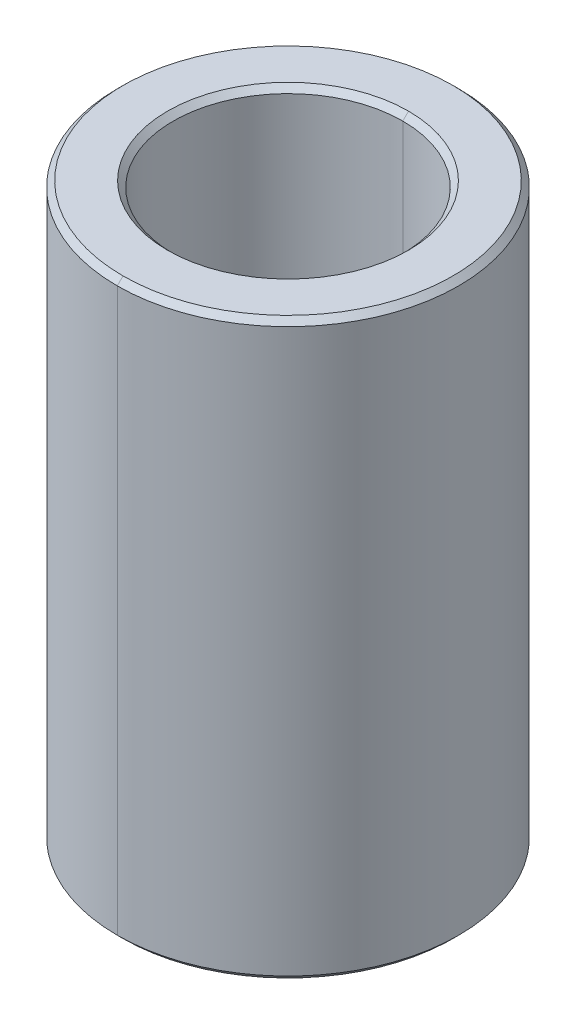
ISO-10303-21;
HEADER;
FILE_DESCRIPTION(('STEP AP214'),'2;1');
FILE_NAME('part.step','',(''),(''),'','','');
FILE_SCHEMA(('AUTOMOTIVE_DESIGN { 1 0 10303 214 1 1 1 1 }'));
ENDSEC;
DATA;
#1=APPLICATION_CONTEXT('core data for automotive mechanical design processes');
#2=APPLICATION_PROTOCOL_DEFINITION('international standard','automotive_design',2000,#1);
#3=PRODUCT_CONTEXT('',#1,'mechanical');
#4=PRODUCT('Part','Part','',(#3));
#5=PRODUCT_RELATED_PRODUCT_CATEGORY('part','',(#4));
#6=PRODUCT_DEFINITION_FORMATION('','',#4);
#7=PRODUCT_DEFINITION_CONTEXT('part definition',#1,'design');
#8=PRODUCT_DEFINITION('design','',#6,#7);
#9=PRODUCT_DEFINITION_SHAPE('','',#8);
#10=(LENGTH_UNIT() NAMED_UNIT(*) SI_UNIT(.MILLI.,.METRE.));
#11=(NAMED_UNIT(*) PLANE_ANGLE_UNIT() SI_UNIT($,.RADIAN.));
#12=(NAMED_UNIT(*) SI_UNIT($,.STERADIAN.) SOLID_ANGLE_UNIT());
#13=UNCERTAINTY_MEASURE_WITH_UNIT(LENGTH_MEASURE(1.E-05),#10,'distance_accuracy_value','');
#14=(GEOMETRIC_REPRESENTATION_CONTEXT(3) GLOBAL_UNCERTAINTY_ASSIGNED_CONTEXT((#13)) GLOBAL_UNIT_ASSIGNED_CONTEXT((#10,
#11,#12)) REPRESENTATION_CONTEXT('',''));
#15=CARTESIAN_POINT('',(0.,0.,0.));
#16=DIRECTION('',(0.,0.,1.));
#17=DIRECTION('',(1.,0.,0.));
#18=AXIS2_PLACEMENT_3D('',#15,#16,#17);
#19=CARTESIAN_POINT('',(0.,4.9,0.));
#20=DIRECTION('',(0.,1.,0.));
#21=DIRECTION('',(0.,0.,1.));
#22=AXIS2_PLACEMENT_3D('',#19,#20,#21);
#23=CONICAL_SURFACE('',#22,2.,0.785398163397448);
#24=DIRECTION('',(0.,0.707106781186548,-0.707106781186548));
#25=VECTOR('',#24,1.);
#26=CARTESIAN_POINT('',(0.,4.9,-2.));
#27=LINE('',#26,#25);
#28=CARTESIAN_POINT('',(0.,4.9,-2.));
#29=VERTEX_POINT('',#28);
#30=CARTESIAN_POINT('',(0.,5.,-2.1));
#31=VERTEX_POINT('',#30);
#32=EDGE_CURVE('E185',#29,#31,#27,.T.);
#33=ORIENTED_EDGE('',*,*,#32,.F.);
#34=CARTESIAN_POINT('',(0.,4.9,0.));
#35=DIRECTION('',(0.,1.,0.));
#36=DIRECTION('',(0.,0.,1.));
#37=AXIS2_PLACEMENT_3D('',#34,#35,#36);
#38=CIRCLE('',#37,2.);
#39=CARTESIAN_POINT('',(0.,4.9,2.));
#40=VERTEX_POINT('',#39);
#41=EDGE_CURVE('E25',#40,#29,#38,.T.);
#42=ORIENTED_EDGE('',*,*,#41,.F.);
#43=DIRECTION('',(0.,0.707106781186548,0.707106781186548));
#44=VECTOR('',#43,1.);
#45=CARTESIAN_POINT('',(0.,4.9,2.));
#46=LINE('',#45,#44);
#47=CARTESIAN_POINT('',(0.,5.,2.1));
#48=VERTEX_POINT('',#47);
#49=EDGE_CURVE('E198',#40,#48,#46,.T.);
#50=ORIENTED_EDGE('',*,*,#49,.T.);
#51=CARTESIAN_POINT('',(0.,5.,0.));
#52=DIRECTION('',(0.,-1.,0.));
#53=DIRECTION('',(0.,0.,1.));
#54=AXIS2_PLACEMENT_3D('',#51,#52,#53);
#55=CIRCLE('',#54,2.1);
#56=EDGE_CURVE('E119',#31,#48,#55,.T.);
#57=ORIENTED_EDGE('',*,*,#56,.F.);
#58=EDGE_LOOP('',(#33,#42,#50,#57));
#59=FACE_BOUND('',#58,.T.);
#60=ADVANCED_FACE('F15',(#59),#23,.F.);
#61=CARTESIAN_POINT('',(0.,-5.,0.));
#62=DIRECTION('',(0.,-1.,0.));
#63=DIRECTION('',(0.,0.,-1.));
#64=AXIS2_PLACEMENT_3D('',#61,#62,#63);
#65=CONICAL_SURFACE('',#64,2.1,0.785398163397443);
#66=DIRECTION('',(0.,-0.707106781186551,0.707106781186545));
#67=VECTOR('',#66,1.);
#68=CARTESIAN_POINT('',(0.,-5.,2.1));
#69=LINE('',#68,#67);
#70=CARTESIAN_POINT('',(0.,-4.9,2.));
#71=VERTEX_POINT('',#70);
#72=CARTESIAN_POINT('',(0.,-5.,2.1));
#73=VERTEX_POINT('',#72);
#74=EDGE_CURVE('E189',#71,#73,#69,.T.);
#75=ORIENTED_EDGE('',*,*,#74,.F.);
#76=CARTESIAN_POINT('',(0.,-4.9,0.));
#77=DIRECTION('',(0.,-1.,0.));
#78=DIRECTION('',(0.,0.,1.));
#79=AXIS2_PLACEMENT_3D('',#76,#77,#78);
#80=CIRCLE('',#79,2.);
#81=CARTESIAN_POINT('',(0.,-4.9,-2.));
#82=VERTEX_POINT('',#81);
#83=EDGE_CURVE('E10',#82,#71,#80,.T.);
#84=ORIENTED_EDGE('',*,*,#83,.F.);
#85=DIRECTION('',(0.,-0.707106781186551,-0.707106781186545));
#86=VECTOR('',#85,1.);
#87=CARTESIAN_POINT('',(0.,-5.,-2.1));
#88=LINE('',#87,#86);
#89=CARTESIAN_POINT('',(0.,-5.,-2.1));
#90=VERTEX_POINT('',#89);
#91=EDGE_CURVE('E131',#82,#90,#88,.T.);
#92=ORIENTED_EDGE('',*,*,#91,.T.);
#93=CARTESIAN_POINT('',(0.,-5.,0.));
#94=DIRECTION('',(0.,1.,0.));
#95=DIRECTION('',(0.,0.,1.));
#96=AXIS2_PLACEMENT_3D('',#93,#94,#95);
#97=CIRCLE('',#96,2.1);
#98=EDGE_CURVE('E82',#73,#90,#97,.T.);
#99=ORIENTED_EDGE('',*,*,#98,.F.);
#100=EDGE_LOOP('',(#75,#84,#92,#99));
#101=FACE_BOUND('',#100,.T.);
#102=ADVANCED_FACE('F250',(#101),#65,.F.);
#103=CARTESIAN_POINT('',(0.,5.,0.));
#104=DIRECTION('',(0.,-1.,0.));
#105=DIRECTION('',(0.,0.,-1.));
#106=AXIS2_PLACEMENT_3D('',#103,#104,#105);
#107=CONICAL_SURFACE('',#106,2.875,0.78539816339744);
#108=DIRECTION('',(0.,-0.707106781186554,0.707106781186542));
#109=VECTOR('',#108,1.);
#110=CARTESIAN_POINT('',(0.,5.,2.875));
#111=LINE('',#110,#109);
#112=CARTESIAN_POINT('',(0.,5.,2.875));
#113=VERTEX_POINT('',#112);
#114=CARTESIAN_POINT('',(0.,4.9,2.975));
#115=VERTEX_POINT('',#114);
#116=EDGE_CURVE('E114',#113,#115,#111,.T.);
#117=ORIENTED_EDGE('',*,*,#116,.F.);
#118=CARTESIAN_POINT('',(0.,5.,0.));
#119=DIRECTION('',(0.,1.,0.));
#120=DIRECTION('',(0.,0.,1.));
#121=AXIS2_PLACEMENT_3D('',#118,#119,#120);
#122=CIRCLE('',#121,2.875);
#123=CARTESIAN_POINT('',(0.,5.,-2.875));
#124=VERTEX_POINT('',#123);
#125=EDGE_CURVE('E108',#124,#113,#122,.T.);
#126=ORIENTED_EDGE('',*,*,#125,.F.);
#127=DIRECTION('',(0.,-0.707106781186554,-0.707106781186542));
#128=VECTOR('',#127,1.);
#129=CARTESIAN_POINT('',(0.,5.,-2.875));
#130=LINE('',#129,#128);
#131=CARTESIAN_POINT('',(0.,4.9,-2.975));
#132=VERTEX_POINT('',#131);
#133=EDGE_CURVE('E111',#124,#132,#130,.T.);
#134=ORIENTED_EDGE('',*,*,#133,.T.);
#135=CARTESIAN_POINT('',(0.,4.9,0.));
#136=DIRECTION('',(0.,-1.,0.));
#137=DIRECTION('',(0.,0.,1.));
#138=AXIS2_PLACEMENT_3D('',#135,#136,#137);
#139=CIRCLE('',#138,2.975);
#140=EDGE_CURVE('E162',#115,#132,#139,.T.);
#141=ORIENTED_EDGE('',*,*,#140,.F.);
#142=EDGE_LOOP('',(#117,#126,#134,#141));
#143=FACE_BOUND('',#142,.T.);
#144=ADVANCED_FACE('F110',(#143),#107,.T.);
#145=CARTESIAN_POINT('',(0.,-4.9,0.));
#146=DIRECTION('',(0.,1.,0.));
#147=DIRECTION('',(0.,0.,1.));
#148=AXIS2_PLACEMENT_3D('',#145,#146,#147);
#149=CONICAL_SURFACE('',#148,2.975,0.785398163397443);
#150=DIRECTION('',(0.,0.707106781186551,-0.707106781186545));
#151=VECTOR('',#150,1.);
#152=CARTESIAN_POINT('',(0.,-4.9,-2.975));
#153=LINE('',#152,#151);
#154=CARTESIAN_POINT('',(0.,-5.,-2.875));
#155=VERTEX_POINT('',#154);
#156=CARTESIAN_POINT('',(0.,-4.9,-2.975));
#157=VERTEX_POINT('',#156);
#158=EDGE_CURVE('E173',#155,#157,#153,.T.);
#159=ORIENTED_EDGE('',*,*,#158,.F.);
#160=CARTESIAN_POINT('',(0.,-5.,0.));
#161=DIRECTION('',(0.,-1.,0.));
#162=DIRECTION('',(0.,0.,1.));
#163=AXIS2_PLACEMENT_3D('',#160,#161,#162);
#164=CIRCLE('',#163,2.875);
#165=CARTESIAN_POINT('',(0.,-5.,2.875));
#166=VERTEX_POINT('',#165);
#167=EDGE_CURVE('E145',#166,#155,#164,.T.);
#168=ORIENTED_EDGE('',*,*,#167,.F.);
#169=DIRECTION('',(0.,0.707106781186551,0.707106781186545));
#170=VECTOR('',#169,1.);
#171=CARTESIAN_POINT('',(0.,-4.9,2.975));
#172=LINE('',#171,#170);
#173=CARTESIAN_POINT('',(0.,-4.9,2.975));
#174=VERTEX_POINT('',#173);
#175=EDGE_CURVE('E201',#166,#174,#172,.T.);
#176=ORIENTED_EDGE('',*,*,#175,.T.);
#177=CARTESIAN_POINT('',(0.,-4.9,0.));
#178=DIRECTION('',(0.,1.,0.));
#179=DIRECTION('',(0.,0.,1.));
#180=AXIS2_PLACEMENT_3D('',#177,#178,#179);
#181=CIRCLE('',#180,2.975);
#182=EDGE_CURVE('E39',#157,#174,#181,.T.);
#183=ORIENTED_EDGE('',*,*,#182,.F.);
#184=EDGE_LOOP('',(#159,#168,#176,#183));
#185=FACE_BOUND('',#184,.T.);
#186=ADVANCED_FACE('F337',(#185),#149,.T.);
#187=CARTESIAN_POINT('',(0.,5.,0.));
#188=DIRECTION('',(0.,-1.,0.));
#189=DIRECTION('',(0.,0.,-1.));
#190=AXIS2_PLACEMENT_3D('',#187,#188,#189);
#191=CYLINDRICAL_SURFACE('',#190,2.);
#192=DIRECTION('',(0.,-1.,0.));
#193=VECTOR('',#192,1.);
#194=CARTESIAN_POINT('',(0.,5.,2.));
#195=LINE('',#194,#193);
#196=EDGE_CURVE('E172',#40,#71,#195,.T.);
#197=ORIENTED_EDGE('',*,*,#196,.F.);
#198=ORIENTED_EDGE('',*,*,#41,.T.);
#199=DIRECTION('',(0.,-1.,0.));
#200=VECTOR('',#199,1.);
#201=CARTESIAN_POINT('',(0.,5.,-2.));
#202=LINE('',#201,#200);
#203=EDGE_CURVE('E168',#29,#82,#202,.T.);
#204=ORIENTED_EDGE('',*,*,#203,.T.);
#205=ORIENTED_EDGE('',*,*,#83,.T.);
#206=EDGE_LOOP('',(#197,#198,#204,#205));
#207=FACE_BOUND('',#206,.T.);
#208=ADVANCED_FACE('F242',(#207),#191,.F.);
#209=CARTESIAN_POINT('',(0.,5.,0.));
#210=DIRECTION('',(0.,-1.,0.));
#211=DIRECTION('',(0.,0.,-1.));
#212=AXIS2_PLACEMENT_3D('',#209,#210,#211);
#213=CYLINDRICAL_SURFACE('',#212,2.975);
#214=DIRECTION('',(0.,-1.,0.));
#215=VECTOR('',#214,1.);
#216=CARTESIAN_POINT('',(0.,5.,2.975));
#217=LINE('',#216,#215);
#218=EDGE_CURVE('E171',#115,#174,#217,.T.);
#219=ORIENTED_EDGE('',*,*,#218,.F.);
#220=ORIENTED_EDGE('',*,*,#140,.T.);
#221=DIRECTION('',(0.,-1.,0.));
#222=VECTOR('',#221,1.);
#223=CARTESIAN_POINT('',(0.,5.,-2.975));
#224=LINE('',#223,#222);
#225=EDGE_CURVE('E120',#132,#157,#224,.T.);
#226=ORIENTED_EDGE('',*,*,#225,.T.);
#227=ORIENTED_EDGE('',*,*,#182,.T.);
#228=EDGE_LOOP('',(#219,#220,#226,#227));
#229=FACE_BOUND('',#228,.T.);
#230=ADVANCED_FACE('F344',(#229),#213,.T.);
#231=CARTESIAN_POINT('',(0.,-5.,0.));
#232=DIRECTION('',(0.,1.,0.));
#233=DIRECTION('',(1.,0.,0.));
#234=AXIS2_PLACEMENT_3D('',#231,#232,#233);
#235=PLANE('',#234);
#236=CARTESIAN_POINT('',(0.,-5.,0.));
#237=DIRECTION('',(0.,1.,0.));
#238=DIRECTION('',(0.,0.,1.));
#239=AXIS2_PLACEMENT_3D('',#236,#237,#238);
#240=CIRCLE('',#239,2.1);
#241=EDGE_CURVE('E140',#90,#73,#240,.T.);
#242=ORIENTED_EDGE('',*,*,#241,.T.);
#243=ORIENTED_EDGE('',*,*,#98,.T.);
#244=EDGE_LOOP('',(#242,#243));
#245=FACE_BOUND('',#244,.T.);
#246=ORIENTED_EDGE('',*,*,#167,.T.);
#247=CARTESIAN_POINT('',(0.,-5.,0.));
#248=DIRECTION('',(0.,-1.,0.));
#249=DIRECTION('',(0.,0.,1.));
#250=AXIS2_PLACEMENT_3D('',#247,#248,#249);
#251=CIRCLE('',#250,2.875);
#252=EDGE_CURVE('E127',#155,#166,#251,.T.);
#253=ORIENTED_EDGE('',*,*,#252,.T.);
#254=EDGE_LOOP('',(#246,#253));
#255=FACE_BOUND('',#254,.T.);
#256=ADVANCED_FACE('F371',(#245,#255),#235,.F.);
#257=CARTESIAN_POINT('',(0.,5.,0.));
#258=DIRECTION('',(0.,1.,0.));
#259=DIRECTION('',(1.,0.,0.));
#260=AXIS2_PLACEMENT_3D('',#257,#258,#259);
#261=PLANE('',#260);
#262=CARTESIAN_POINT('',(0.,5.,0.));
#263=DIRECTION('',(0.,-1.,0.));
#264=DIRECTION('',(0.,0.,1.));
#265=AXIS2_PLACEMENT_3D('',#262,#263,#264);
#266=CIRCLE('',#265,2.1);
#267=EDGE_CURVE('E166',#48,#31,#266,.T.);
#268=ORIENTED_EDGE('',*,*,#267,.T.);
#269=ORIENTED_EDGE('',*,*,#56,.T.);
#270=EDGE_LOOP('',(#268,#269));
#271=FACE_BOUND('',#270,.T.);
#272=ORIENTED_EDGE('',*,*,#125,.T.);
#273=CARTESIAN_POINT('',(0.,5.,0.));
#274=DIRECTION('',(0.,1.,0.));
#275=DIRECTION('',(0.,0.,1.));
#276=AXIS2_PLACEMENT_3D('',#273,#274,#275);
#277=CIRCLE('',#276,2.875);
#278=EDGE_CURVE('E123',#113,#124,#277,.T.);
#279=ORIENTED_EDGE('',*,*,#278,.T.);
#280=EDGE_LOOP('',(#272,#279));
#281=FACE_BOUND('',#280,.T.);
#282=ADVANCED_FACE('F129',(#271,#281),#261,.T.);
#283=CARTESIAN_POINT('',(0.,5.,0.));
#284=DIRECTION('',(0.,-1.,0.));
#285=DIRECTION('',(0.,0.,-1.));
#286=AXIS2_PLACEMENT_3D('',#283,#284,#285);
#287=CYLINDRICAL_SURFACE('',#286,2.975);
#288=CARTESIAN_POINT('',(0.,4.9,0.));
#289=DIRECTION('',(0.,-1.,0.));
#290=DIRECTION('',(0.,0.,1.));
#291=AXIS2_PLACEMENT_3D('',#288,#289,#290);
#292=CIRCLE('',#291,2.975);
#293=EDGE_CURVE('E125',#132,#115,#292,.T.);
#294=ORIENTED_EDGE('',*,*,#293,.T.);
#295=ORIENTED_EDGE('',*,*,#218,.T.);
#296=CARTESIAN_POINT('',(0.,-4.9,0.));
#297=DIRECTION('',(0.,1.,0.));
#298=DIRECTION('',(0.,0.,1.));
#299=AXIS2_PLACEMENT_3D('',#296,#297,#298);
#300=CIRCLE('',#299,2.975);
#301=EDGE_CURVE('E177',#174,#157,#300,.T.);
#302=ORIENTED_EDGE('',*,*,#301,.T.);
#303=ORIENTED_EDGE('',*,*,#225,.F.);
#304=EDGE_LOOP('',(#294,#295,#302,#303));
#305=FACE_BOUND('',#304,.T.);
#306=ADVANCED_FACE('F349',(#305),#287,.T.);
#307=CARTESIAN_POINT('',(0.,5.,0.));
#308=DIRECTION('',(0.,-1.,0.));
#309=DIRECTION('',(0.,0.,-1.));
#310=AXIS2_PLACEMENT_3D('',#307,#308,#309);
#311=CYLINDRICAL_SURFACE('',#310,2.);
#312=CARTESIAN_POINT('',(0.,4.9,0.));
#313=DIRECTION('',(0.,1.,0.));
#314=DIRECTION('',(0.,0.,1.));
#315=AXIS2_PLACEMENT_3D('',#312,#313,#314);
#316=CIRCLE('',#315,2.);
#317=EDGE_CURVE('E182',#29,#40,#316,.T.);
#318=ORIENTED_EDGE('',*,*,#317,.T.);
#319=ORIENTED_EDGE('',*,*,#196,.T.);
#320=CARTESIAN_POINT('',(0.,-4.9,0.));
#321=DIRECTION('',(0.,-1.,0.));
#322=DIRECTION('',(0.,0.,1.));
#323=AXIS2_PLACEMENT_3D('',#320,#321,#322);
#324=CIRCLE('',#323,2.);
#325=EDGE_CURVE('E193',#71,#82,#324,.T.);
#326=ORIENTED_EDGE('',*,*,#325,.T.);
#327=ORIENTED_EDGE('',*,*,#203,.F.);
#328=EDGE_LOOP('',(#318,#319,#326,#327));
#329=FACE_BOUND('',#328,.T.);
#330=ADVANCED_FACE('F244',(#329),#311,.F.);
#331=CARTESIAN_POINT('',(0.,-4.9,0.));
#332=DIRECTION('',(0.,1.,0.));
#333=DIRECTION('',(0.,0.,1.));
#334=AXIS2_PLACEMENT_3D('',#331,#332,#333);
#335=CONICAL_SURFACE('',#334,2.975,0.785398163397443);
#336=ORIENTED_EDGE('',*,*,#252,.F.);
#337=ORIENTED_EDGE('',*,*,#158,.T.);
#338=ORIENTED_EDGE('',*,*,#301,.F.);
#339=ORIENTED_EDGE('',*,*,#175,.F.);
#340=EDGE_LOOP('',(#336,#337,#338,#339));
#341=FACE_BOUND('',#340,.T.);
#342=ADVANCED_FACE('F410',(#341),#335,.T.);
#343=CARTESIAN_POINT('',(0.,5.,0.));
#344=DIRECTION('',(0.,-1.,0.));
#345=DIRECTION('',(0.,0.,-1.));
#346=AXIS2_PLACEMENT_3D('',#343,#344,#345);
#347=CONICAL_SURFACE('',#346,2.875,0.78539816339744);
#348=ORIENTED_EDGE('',*,*,#278,.F.);
#349=ORIENTED_EDGE('',*,*,#116,.T.);
#350=ORIENTED_EDGE('',*,*,#293,.F.);
#351=ORIENTED_EDGE('',*,*,#133,.F.);
#352=EDGE_LOOP('',(#348,#349,#350,#351));
#353=FACE_BOUND('',#352,.T.);
#354=ADVANCED_FACE('F122',(#353),#347,.T.);
#355=CARTESIAN_POINT('',(0.,-5.,0.));
#356=DIRECTION('',(0.,-1.,0.));
#357=DIRECTION('',(0.,0.,-1.));
#358=AXIS2_PLACEMENT_3D('',#355,#356,#357);
#359=CONICAL_SURFACE('',#358,2.1,0.785398163397443);
#360=ORIENTED_EDGE('',*,*,#325,.F.);
#361=ORIENTED_EDGE('',*,*,#74,.T.);
#362=ORIENTED_EDGE('',*,*,#241,.F.);
#363=ORIENTED_EDGE('',*,*,#91,.F.);
#364=EDGE_LOOP('',(#360,#361,#362,#363));
#365=FACE_BOUND('',#364,.T.);
#366=ADVANCED_FACE('F249',(#365),#359,.F.);
#367=CARTESIAN_POINT('',(0.,4.9,0.));
#368=DIRECTION('',(0.,1.,0.));
#369=DIRECTION('',(0.,0.,1.));
#370=AXIS2_PLACEMENT_3D('',#367,#368,#369);
#371=CONICAL_SURFACE('',#370,2.,0.785398163397448);
#372=ORIENTED_EDGE('',*,*,#317,.F.);
#373=ORIENTED_EDGE('',*,*,#32,.T.);
#374=ORIENTED_EDGE('',*,*,#267,.F.);
#375=ORIENTED_EDGE('',*,*,#49,.F.);
#376=EDGE_LOOP('',(#372,#373,#374,#375));
#377=FACE_BOUND('',#376,.T.);
#378=ADVANCED_FACE('F17',(#377),#371,.F.);
#379=CLOSED_SHELL('',(#60,#102,#144,#186,#208,#230,#256,#282,#306,#330,#342,#354,#366,#378));
#380=MANIFOLD_SOLID_BREP('B1',#379);
#381=ADVANCED_BREP_SHAPE_REPRESENTATION('',(#18,#380),#14);
#382=SHAPE_DEFINITION_REPRESENTATION(#9,#381);
ENDSEC;
END-ISO-10303-21;
